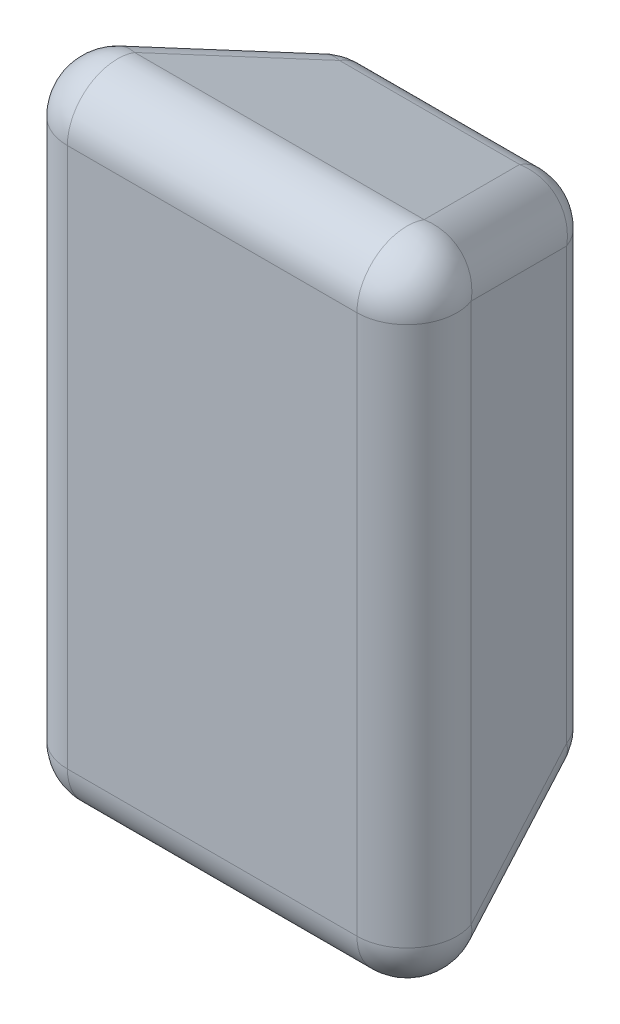
ISO-10303-21;
HEADER;
FILE_DESCRIPTION(('STEP AP214'),'2;1');
FILE_NAME('part.step','',(''),(''),'','','');
FILE_SCHEMA(('AUTOMOTIVE_DESIGN { 1 0 10303 214 1 1 1 1 }'));
ENDSEC;
DATA;
#1=APPLICATION_CONTEXT('core data for automotive mechanical design processes');
#2=APPLICATION_PROTOCOL_DEFINITION('international standard','automotive_design',2000,#1);
#3=PRODUCT_CONTEXT('',#1,'mechanical');
#4=PRODUCT('Part','Part','',(#3));
#5=PRODUCT_RELATED_PRODUCT_CATEGORY('part','',(#4));
#6=PRODUCT_DEFINITION_FORMATION('','',#4);
#7=PRODUCT_DEFINITION_CONTEXT('part definition',#1,'design');
#8=PRODUCT_DEFINITION('design','',#6,#7);
#9=PRODUCT_DEFINITION_SHAPE('','',#8);
#10=(LENGTH_UNIT() NAMED_UNIT(*) SI_UNIT(.MILLI.,.METRE.));
#11=(NAMED_UNIT(*) PLANE_ANGLE_UNIT() SI_UNIT($,.RADIAN.));
#12=(NAMED_UNIT(*) SI_UNIT($,.STERADIAN.) SOLID_ANGLE_UNIT());
#13=UNCERTAINTY_MEASURE_WITH_UNIT(LENGTH_MEASURE(1.E-05),#10,'distance_accuracy_value','');
#14=(GEOMETRIC_REPRESENTATION_CONTEXT(3) GLOBAL_UNCERTAINTY_ASSIGNED_CONTEXT((#13)) GLOBAL_UNIT_ASSIGNED_CONTEXT((#10,
#11,#12)) REPRESENTATION_CONTEXT('',''));
#15=CARTESIAN_POINT('',(0.,0.,0.));
#16=DIRECTION('',(0.,0.,1.));
#17=DIRECTION('',(1.,0.,0.));
#18=AXIS2_PLACEMENT_3D('',#15,#16,#17);
#19=CARTESIAN_POINT('',(-28.2934494803903,-54.2371973661256,0.));
#20=DIRECTION('',(-0.939692620785908,0.,-0.342020143325669));
#21=DIRECTION('',(-0.342020143325669,0.,0.939692620785909));
#22=AXIS2_PLACEMENT_3D('',#19,#20,#21);
#23=PLANE('',#22);
#24=DIRECTION('',(-0.323615577118185,-0.323615577118185,0.889126490715988));
#25=VECTOR('',#24,1.);
#26=CARTESIAN_POINT('',(-18.804857588362,-135.351679266238,-26.0696919657677));
#27=LINE('',#26,#25);
#28=CARTESIAN_POINT('',(-30.6883003061523,-147.235121984029,6.57979856674331));
#29=VERTEX_POINT('',#28);
#30=CARTESIAN_POINT('',(-41.6074073341383,-158.154229012015,36.5797985667433));
#31=VERTEX_POINT('',#30);
#32=EDGE_CURVE('E168',#29,#31,#27,.T.);
#33=ORIENTED_EDGE('',*,*,#32,.T.);
#34=DIRECTION('',(0.,-1.,0.));
#35=VECTOR('',#34,1.);
#36=CARTESIAN_POINT('',(-41.6074073341383,-36.0386856528155,36.5797985667433));
#37=LINE('',#36,#35);
#38=CARTESIAN_POINT('',(-41.6074073341383,-50.3201657202367,36.5797985667433));
#39=VERTEX_POINT('',#38);
#40=EDGE_CURVE('E170',#31,#39,#37,.F.);
#41=ORIENTED_EDGE('',*,*,#40,.T.);
#42=DIRECTION('',(0.323615577118185,-0.323615577118185,-0.889126490715988));
#43=VECTOR('',#42,1.);
#44=CARTESIAN_POINT('',(-29.2775617637156,-62.6500112906594,2.70382627664434));
#45=LINE('',#44,#43);
#46=CARTESIAN_POINT('',(-30.6883003061522,-61.2392727482227,6.57979856674331));
#47=VERTEX_POINT('',#46);
#48=EDGE_CURVE('E164',#39,#47,#45,.T.);
#49=ORIENTED_EDGE('',*,*,#48,.T.);
#50=DIRECTION('',(0.,-1.,0.));
#51=VECTOR('',#50,1.);
#52=CARTESIAN_POINT('',(-30.6883003061522,-54.2371973661256,6.57979856674331));
#53=LINE('',#52,#51);
#54=EDGE_CURVE('E166',#47,#29,#53,.T.);
#55=ORIENTED_EDGE('',*,*,#54,.T.);
#56=EDGE_LOOP('',(#33,#41,#49,#55));
#57=FACE_BOUND('',#56,.T.);
#58=ADVANCED_FACE('F33',(#57),#23,.T.);
#59=CARTESIAN_POINT('',(-28.2934494803903,-154.237197366126,0.));
#60=DIRECTION('',(0.,-0.939692620785908,-0.342020143325669));
#61=DIRECTION('',(0.,0.342020143325669,-0.939692620785909));
#62=AXIS2_PLACEMENT_3D('',#59,#60,#61);
#63=PLANE('',#62);
#64=DIRECTION('',(-0.323615577118185,0.323615577118185,-0.889126490715988));
#65=VECTOR('',#64,1.);
#66=CARTESIAN_POINT('',(31.4922483083862,-173.419821362761,52.7038262766443));
#67=LINE('',#66,#65);
#68=CARTESIAN_POINT('',(14.7044751375127,-156.632048191888,6.57979856674331));
#69=VERTEX_POINT('',#68);
#70=CARTESIAN_POINT('',(25.6235821654987,-167.551155219874,36.5797985667433));
#71=VERTEX_POINT('',#70);
#72=EDGE_CURVE('E173',#69,#71,#67,.F.);
#73=ORIENTED_EDGE('',*,*,#72,.T.);
#74=DIRECTION('',(1.,0.,0.));
#75=VECTOR('',#74,1.);
#76=CARTESIAN_POINT('',(-46.4919611937004,-167.551155219874,36.5797985667433));
#77=LINE('',#76,#75);
#78=CARTESIAN_POINT('',(-32.2104811262793,-167.551155219874,36.5797985667433));
#79=VERTEX_POINT('',#78);
#80=EDGE_CURVE('E179',#71,#79,#77,.F.);
#81=ORIENTED_EDGE('',*,*,#80,.T.);
#82=DIRECTION('',(-0.323615577118185,-0.323615577118185,0.889126490715988));
#83=VECTOR('',#82,1.);
#84=CARTESIAN_POINT('',(-19.8806355558565,-155.221309649451,2.70382627664433));
#85=LINE('',#84,#83);
#86=CARTESIAN_POINT('',(-21.2913740982932,-156.632048191888,6.57979856674331));
#87=VERTEX_POINT('',#86);
#88=EDGE_CURVE('E177',#79,#87,#85,.F.);
#89=ORIENTED_EDGE('',*,*,#88,.T.);
#90=DIRECTION('',(1.,0.,0.));
#91=VECTOR('',#90,1.);
#92=CARTESIAN_POINT('',(-28.2934494803903,-156.632048191888,6.57979856674331));
#93=LINE('',#92,#91);
#94=EDGE_CURVE('E175',#87,#69,#93,.T.);
#95=ORIENTED_EDGE('',*,*,#94,.T.);
#96=EDGE_LOOP('',(#73,#81,#89,#95));
#97=FACE_BOUND('',#96,.T.);
#98=ADVANCED_FACE('F267',(#97),#63,.T.);
#99=CARTESIAN_POINT('',(21.7065505196098,-54.2371973661256,0.));
#100=DIRECTION('',(0.939692620785908,0.,-0.342020143325669));
#101=DIRECTION('',(-0.342020143325669,0.,-0.939692620785909));
#102=AXIS2_PLACEMENT_3D('',#99,#100,#101);
#103=PLANE('',#102);
#104=DIRECTION('',(0.,-1.,0.));
#105=VECTOR('',#104,1.);
#106=CARTESIAN_POINT('',(24.1014013453717,-54.2371973661256,6.57979856674331));
#107=LINE('',#106,#105);
#108=CARTESIAN_POINT('',(24.1014013453718,-147.235121984029,6.57979856674331));
#109=VERTEX_POINT('',#108);
#110=CARTESIAN_POINT('',(24.1014013453717,-61.2392727482227,6.57979856674331));
#111=VERTEX_POINT('',#110);
#112=EDGE_CURVE('E194',#109,#111,#107,.F.);
#113=ORIENTED_EDGE('',*,*,#112,.T.);
#114=DIRECTION('',(-0.323615577118185,-0.323615577118185,-0.889126490715988));
#115=VECTOR('',#114,1.);
#116=CARTESIAN_POINT('',(22.6906628029351,-62.6500112906594,2.70382627664434));
#117=LINE('',#116,#115);
#118=CARTESIAN_POINT('',(35.0205083733578,-50.3201657202367,36.5797985667433));
#119=VERTEX_POINT('',#118);
#120=EDGE_CURVE('E197',#111,#119,#117,.F.);
#121=ORIENTED_EDGE('',*,*,#120,.T.);
#122=DIRECTION('',(0.,-1.,0.));
#123=VECTOR('',#122,1.);
#124=CARTESIAN_POINT('',(35.0205083733578,-54.2371973661256,36.5797985667433));
#125=LINE('',#124,#123);
#126=CARTESIAN_POINT('',(35.0205083733578,-158.154229012015,36.5797985667433));
#127=VERTEX_POINT('',#126);
#128=EDGE_CURVE('E139',#119,#127,#125,.T.);
#129=ORIENTED_EDGE('',*,*,#128,.T.);
#130=DIRECTION('',(0.323615577118185,-0.323615577118185,0.889126490715988));
#131=VECTOR('',#130,1.);
#132=CARTESIAN_POINT('',(22.6906628029351,-145.824383441592,2.70382627664433));
#133=LINE('',#132,#131);
#134=EDGE_CURVE('E191',#127,#109,#133,.F.);
#135=ORIENTED_EDGE('',*,*,#134,.T.);
#136=EDGE_LOOP('',(#113,#121,#129,#135));
#137=FACE_BOUND('',#136,.T.);
#138=ADVANCED_FACE('F298',(#137),#103,.T.);
#139=CARTESIAN_POINT('',(-28.2934494803903,-54.2371973661256,0.));
#140=DIRECTION('',(0.,0.939692620785908,-0.342020143325669));
#141=DIRECTION('',(0.,0.342020143325669,0.939692620785909));
#142=AXIS2_PLACEMENT_3D('',#139,#140,#141);
#143=PLANE('',#142);
#144=DIRECTION('',(1.,0.,0.));
#145=VECTOR('',#144,1.);
#146=CARTESIAN_POINT('',(-28.2934494803903,-51.8423465403637,6.57979856674331));
#147=LINE('',#146,#145);
#148=CARTESIAN_POINT('',(14.7044751375127,-51.8423465403637,6.57979856674331));
#149=VERTEX_POINT('',#148);
#150=CARTESIAN_POINT('',(-21.2913740982932,-51.8423465403637,6.57979856674331));
#151=VERTEX_POINT('',#150);
#152=EDGE_CURVE('E42',#149,#151,#147,.F.);
#153=ORIENTED_EDGE('',*,*,#152,.T.);
#154=DIRECTION('',(-0.323615577118185,0.323615577118185,0.889126490715988));
#155=VECTOR('',#154,1.);
#156=CARTESIAN_POINT('',(-38.0791472691667,-35.0545733694902,52.7038262766443));
#157=LINE('',#156,#155);
#158=CARTESIAN_POINT('',(-32.2104811262792,-40.9232395123776,36.5797985667433));
#159=VERTEX_POINT('',#158);
#160=EDGE_CURVE('E11',#151,#159,#157,.T.);
#161=ORIENTED_EDGE('',*,*,#160,.T.);
#162=DIRECTION('',(1.,0.,0.));
#163=VECTOR('',#162,1.);
#164=CARTESIAN_POINT('',(-28.2934494803903,-40.9232395123776,36.5797985667433));
#165=LINE('',#164,#163);
#166=CARTESIAN_POINT('',(25.6235821654987,-40.9232395123776,36.5797985667433));
#167=VERTEX_POINT('',#166);
#168=EDGE_CURVE('E201',#159,#167,#165,.T.);
#169=ORIENTED_EDGE('',*,*,#168,.T.);
#170=DIRECTION('',(-0.323615577118185,-0.323615577118185,-0.889126490715988));
#171=VECTOR('',#170,1.);
#172=CARTESIAN_POINT('',(8.05738450739923,-58.4894371704771,-11.6829328445617));
#173=LINE('',#172,#171);
#174=EDGE_CURVE('E199',#167,#149,#173,.T.);
#175=ORIENTED_EDGE('',*,*,#174,.T.);
#176=EDGE_LOOP('',(#153,#161,#169,#175));
#177=FACE_BOUND('',#176,.T.);
#178=ADVANCED_FACE('F300',(#177),#143,.T.);
#179=CARTESIAN_POINT('',(0.,0.,50.));
#180=DIRECTION('',(0.,0.,1.));
#181=DIRECTION('',(1.,0.,0.));
#182=AXIS2_PLACEMENT_3D('',#179,#180,#181);
#183=PLANE('',#182);
#184=DIRECTION('',(1.,0.,0.));
#185=VECTOR('',#184,1.);
#186=CARTESIAN_POINT('',(0.,-50.3201657202367,50.));
#187=LINE('',#186,#185);
#188=CARTESIAN_POINT('',(25.6235821654987,-50.3201657202367,50.));
#189=VERTEX_POINT('',#188);
#190=CARTESIAN_POINT('',(-32.2104811262792,-50.3201657202367,50.));
#191=VERTEX_POINT('',#190);
#192=EDGE_CURVE('E126',#189,#191,#187,.F.);
#193=ORIENTED_EDGE('',*,*,#192,.T.);
#194=DIRECTION('',(0.,1.,0.));
#195=VECTOR('',#194,1.);
#196=CARTESIAN_POINT('',(-32.2104811262792,-172.435709079436,50.));
#197=LINE('',#196,#195);
#198=CARTESIAN_POINT('',(-32.2104811262792,-158.154229012015,50.));
#199=VERTEX_POINT('',#198);
#200=EDGE_CURVE('E162',#191,#199,#197,.F.);
#201=ORIENTED_EDGE('',*,*,#200,.T.);
#202=DIRECTION('',(-1.,0.,0.));
#203=VECTOR('',#202,1.);
#204=CARTESIAN_POINT('',(39.9050622329199,-158.154229012015,50.));
#205=LINE('',#204,#203);
#206=CARTESIAN_POINT('',(25.6235821654987,-158.154229012015,50.));
#207=VERTEX_POINT('',#206);
#208=EDGE_CURVE('E129',#199,#207,#205,.F.);
#209=ORIENTED_EDGE('',*,*,#208,.T.);
#210=DIRECTION('',(0.,-1.,0.));
#211=VECTOR('',#210,1.);
#212=CARTESIAN_POINT('',(25.6235821654987,0.,50.));
#213=LINE('',#212,#211);
#214=EDGE_CURVE('E121',#207,#189,#213,.F.);
#215=ORIENTED_EDGE('',*,*,#214,.T.);
#216=EDGE_LOOP('',(#193,#201,#209,#215));
#217=FACE_BOUND('',#216,.T.);
#218=ADVANCED_FACE('F123',(#217),#183,.T.);
#219=CARTESIAN_POINT('',(0.,0.,0.));
#220=DIRECTION('',(0.,0.,1.));
#221=DIRECTION('',(1.,0.,0.));
#222=AXIS2_PLACEMENT_3D('',#219,#220,#221);
#223=PLANE('',#222);
#224=DIRECTION('',(-1.,0.,0.));
#225=VECTOR('',#224,1.);
#226=CARTESIAN_POINT('',(0.,-147.235121984029,0.));
#227=LINE('',#226,#225);
#228=CARTESIAN_POINT('',(14.7044751375127,-147.235121984029,0.));
#229=VERTEX_POINT('',#228);
#230=CARTESIAN_POINT('',(-21.2913740982932,-147.235121984029,0.));
#231=VERTEX_POINT('',#230);
#232=EDGE_CURVE('E186',#229,#231,#227,.T.);
#233=ORIENTED_EDGE('',*,*,#232,.T.);
#234=DIRECTION('',(0.,1.,0.));
#235=VECTOR('',#234,1.);
#236=CARTESIAN_POINT('',(-21.2913740982932,0.,0.));
#237=LINE('',#236,#235);
#238=CARTESIAN_POINT('',(-21.2913740982932,-61.2392727482228,0.));
#239=VERTEX_POINT('',#238);
#240=EDGE_CURVE('E188',#231,#239,#237,.T.);
#241=ORIENTED_EDGE('',*,*,#240,.T.);
#242=DIRECTION('',(1.,0.,0.));
#243=VECTOR('',#242,1.);
#244=CARTESIAN_POINT('',(21.7065505196098,-61.2392727482228,0.));
#245=LINE('',#244,#243);
#246=CARTESIAN_POINT('',(14.7044751375127,-61.2392727482228,0.));
#247=VERTEX_POINT('',#246);
#248=EDGE_CURVE('E182',#239,#247,#245,.T.);
#249=ORIENTED_EDGE('',*,*,#248,.T.);
#250=DIRECTION('',(0.,-1.,0.));
#251=VECTOR('',#250,1.);
#252=CARTESIAN_POINT('',(14.7044751375127,-154.237197366126,0.));
#253=LINE('',#252,#251);
#254=EDGE_CURVE('E184',#247,#229,#253,.T.);
#255=ORIENTED_EDGE('',*,*,#254,.T.);
#256=EDGE_LOOP('',(#233,#241,#249,#255));
#257=FACE_BOUND('',#256,.T.);
#258=ADVANCED_FACE('F276',(#257),#223,.F.);
#259=CARTESIAN_POINT('',(14.7044751375126,0.,10.));
#260=DIRECTION('',(0.,1.,0.));
#261=DIRECTION('',(-1.,0.,0.));
#262=AXIS2_PLACEMENT_3D('',#259,#260,#261);
#263=CYLINDRICAL_SURFACE('',#262,10.);
#264=CARTESIAN_POINT('',(14.7044751375127,-61.2392727482227,10.));
#265=DIRECTION('',(0.,1.,0.));
#266=DIRECTION('',(0.,0.,1.));
#267=AXIS2_PLACEMENT_3D('',#264,#265,#266);
#268=CIRCLE('',#267,10.);
#269=EDGE_CURVE('E37',#111,#247,#268,.T.);
#270=ORIENTED_EDGE('',*,*,#269,.F.);
#271=ORIENTED_EDGE('',*,*,#112,.F.);
#272=CARTESIAN_POINT('',(14.7044751375127,-147.235121984029,10.));
#273=DIRECTION('',(0.,-1.,0.));
#274=DIRECTION('',(1.,0.,0.));
#275=AXIS2_PLACEMENT_3D('',#272,#273,#274);
#276=CIRCLE('',#275,10.);
#277=EDGE_CURVE('E159',#229,#109,#276,.T.);
#278=ORIENTED_EDGE('',*,*,#277,.F.);
#279=ORIENTED_EDGE('',*,*,#254,.F.);
#280=EDGE_LOOP('',(#270,#271,#278,#279));
#281=FACE_BOUND('',#280,.T.);
#282=ADVANCED_FACE('F35',(#281),#263,.T.);
#283=CARTESIAN_POINT('',(14.7044751375127,-61.2392727482228,10.));
#284=DIRECTION('',(0.,0.,1.));
#285=DIRECTION('',(1.,0.,0.));
#286=AXIS2_PLACEMENT_3D('',#283,#284,#285);
#287=SPHERICAL_SURFACE('',#286,10.);
#288=CARTESIAN_POINT('',(14.7044751375127,-61.2392727482227,10.));
#289=DIRECTION('',(-0.323615577118184,-0.323615577118185,-0.889126490715988));
#290=DIRECTION('',(0.,0.939692620785908,-0.342020143325669));
#291=AXIS2_PLACEMENT_3D('',#288,#289,#290);
#292=CIRCLE('',#291,10.);
#293=EDGE_CURVE('E245',#111,#149,#292,.F.);
#294=ORIENTED_EDGE('',*,*,#293,.F.);
#295=ORIENTED_EDGE('',*,*,#269,.T.);
#296=CARTESIAN_POINT('',(14.7044751375127,-61.2392727482228,10.));
#297=DIRECTION('',(1.,0.,0.));
#298=DIRECTION('',(0.,1.,0.));
#299=AXIS2_PLACEMENT_3D('',#296,#297,#298);
#300=CIRCLE('',#299,10.);
#301=EDGE_CURVE('E248',#149,#247,#300,.F.);
#302=ORIENTED_EDGE('',*,*,#301,.F.);
#303=EDGE_LOOP('',(#294,#295,#302));
#304=FACE_BOUND('',#303,.T.);
#305=ADVANCED_FACE('F293',(#304),#287,.T.);
#306=CARTESIAN_POINT('',(14.7044751375127,-147.235121984029,10.));
#307=DIRECTION('',(0.,0.,1.));
#308=DIRECTION('',(1.,0.,0.));
#309=AXIS2_PLACEMENT_3D('',#306,#307,#308);
#310=SPHERICAL_SURFACE('',#309,10.);
#311=CARTESIAN_POINT('',(14.7044751375127,-147.235121984029,10.));
#312=DIRECTION('',(1.,0.,0.));
#313=DIRECTION('',(0.,1.,0.));
#314=AXIS2_PLACEMENT_3D('',#311,#312,#313);
#315=CIRCLE('',#314,10.);
#316=EDGE_CURVE('E239',#229,#69,#315,.F.);
#317=ORIENTED_EDGE('',*,*,#316,.F.);
#318=ORIENTED_EDGE('',*,*,#277,.T.);
#319=CARTESIAN_POINT('',(14.7044751375127,-147.235121984029,10.));
#320=DIRECTION('',(-0.323615577118185,0.323615577118186,-0.889126490715988));
#321=DIRECTION('',(0.,0.939692620785908,0.34202014332567));
#322=AXIS2_PLACEMENT_3D('',#319,#320,#321);
#323=CIRCLE('',#322,10.);
#324=EDGE_CURVE('E242',#69,#109,#323,.F.);
#325=ORIENTED_EDGE('',*,*,#324,.F.);
#326=EDGE_LOOP('',(#317,#318,#325));
#327=FACE_BOUND('',#326,.T.);
#328=ADVANCED_FACE('F255',(#327),#310,.T.);
#329=CARTESIAN_POINT('',(0.,-61.2392727482228,10.));
#330=DIRECTION('',(-1.,0.,0.));
#331=DIRECTION('',(0.,0.,1.));
#332=AXIS2_PLACEMENT_3D('',#329,#330,#331);
#333=CYLINDRICAL_SURFACE('',#332,10.);
#334=ORIENTED_EDGE('',*,*,#301,.T.);
#335=ORIENTED_EDGE('',*,*,#248,.F.);
#336=CARTESIAN_POINT('',(-21.2913740982932,-61.2392727482227,10.));
#337=DIRECTION('',(-1.,0.,0.));
#338=DIRECTION('',(0.,0.,1.));
#339=AXIS2_PLACEMENT_3D('',#336,#337,#338);
#340=CIRCLE('',#339,10.);
#341=EDGE_CURVE('E234',#151,#239,#340,.T.);
#342=ORIENTED_EDGE('',*,*,#341,.F.);
#343=ORIENTED_EDGE('',*,*,#152,.F.);
#344=EDGE_LOOP('',(#334,#335,#342,#343));
#345=FACE_BOUND('',#344,.T.);
#346=ADVANCED_FACE('F287',(#345),#333,.T.);
#347=CARTESIAN_POINT('',(8.05738450739923,-67.8863633783362,-8.26273141130502));
#348=DIRECTION('',(-0.323615577118185,-0.323615577118185,-0.889126490715988));
#349=DIRECTION('',(0.,0.939692620785908,-0.342020143325669));
#350=AXIS2_PLACEMENT_3D('',#347,#348,#349);
#351=CYLINDRICAL_SURFACE('',#350,10.);
#352=ORIENTED_EDGE('',*,*,#293,.T.);
#353=ORIENTED_EDGE('',*,*,#174,.F.);
#354=CARTESIAN_POINT('',(25.6235821654987,-50.3201657202367,40.));
#355=DIRECTION('',(0.323615577118185,0.323615577118185,0.889126490715988));
#356=DIRECTION('',(0.,-0.939692620785908,0.342020143325669));
#357=AXIS2_PLACEMENT_3D('',#354,#355,#356);
#358=CIRCLE('',#357,10.);
#359=EDGE_CURVE('E143',#119,#167,#358,.T.);
#360=ORIENTED_EDGE('',*,*,#359,.F.);
#361=ORIENTED_EDGE('',*,*,#120,.F.);
#362=EDGE_LOOP('',(#352,#353,#360,#361));
#363=FACE_BOUND('',#362,.T.);
#364=ADVANCED_FACE('F296',(#363),#351,.T.);
#365=CARTESIAN_POINT('',(25.6235821654987,-54.2371973661256,40.));
#366=DIRECTION('',(0.,-1.,0.));
#367=DIRECTION('',(1.,0.,0.));
#368=AXIS2_PLACEMENT_3D('',#365,#366,#367);
#369=CYLINDRICAL_SURFACE('',#368,10.);
#370=CARTESIAN_POINT('',(25.6235821654987,-158.154229012015,40.));
#371=DIRECTION('',(0.,-1.,0.));
#372=DIRECTION('',(0.,0.,-1.));
#373=AXIS2_PLACEMENT_3D('',#370,#371,#372);
#374=CIRCLE('',#373,10.);
#375=EDGE_CURVE('E144',#127,#207,#374,.T.);
#376=ORIENTED_EDGE('',*,*,#375,.F.);
#377=ORIENTED_EDGE('',*,*,#128,.F.);
#378=CARTESIAN_POINT('',(25.6235821654987,-50.3201657202367,40.));
#379=DIRECTION('',(0.,1.,0.));
#380=DIRECTION('',(-1.,0.,0.));
#381=AXIS2_PLACEMENT_3D('',#378,#379,#380);
#382=CIRCLE('',#381,10.);
#383=EDGE_CURVE('E136',#189,#119,#382,.T.);
#384=ORIENTED_EDGE('',*,*,#383,.F.);
#385=ORIENTED_EDGE('',*,*,#214,.F.);
#386=EDGE_LOOP('',(#376,#377,#384,#385));
#387=FACE_BOUND('',#386,.T.);
#388=ADVANCED_FACE('F138',(#387),#369,.T.);
#389=CARTESIAN_POINT('',(2.82103241972244,-135.351679266238,-22.6494905325111));
#390=DIRECTION('',(-0.323615577118185,0.323615577118185,-0.889126490715988));
#391=DIRECTION('',(0.,0.939692620785908,0.342020143325669));
#392=AXIS2_PLACEMENT_3D('',#389,#390,#391);
#393=CYLINDRICAL_SURFACE('',#392,10.);
#394=ORIENTED_EDGE('',*,*,#324,.T.);
#395=ORIENTED_EDGE('',*,*,#134,.F.);
#396=CARTESIAN_POINT('',(25.6235821654987,-158.154229012015,40.));
#397=DIRECTION('',(0.323615577118184,-0.323615577118185,0.889126490715988));
#398=DIRECTION('',(0.,-0.939692620785908,-0.342020143325669));
#399=AXIS2_PLACEMENT_3D('',#396,#397,#398);
#400=CIRCLE('',#399,10.);
#401=EDGE_CURVE('E229',#71,#127,#400,.T.);
#402=ORIENTED_EDGE('',*,*,#401,.F.);
#403=ORIENTED_EDGE('',*,*,#72,.F.);
#404=EDGE_LOOP('',(#394,#395,#402,#403));
#405=FACE_BOUND('',#404,.T.);
#406=ADVANCED_FACE('F263',(#405),#393,.T.);
#407=CARTESIAN_POINT('',(-28.2934494803903,-147.235121984029,10.));
#408=DIRECTION('',(-1.,0.,0.));
#409=DIRECTION('',(0.,-1.,0.));
#410=AXIS2_PLACEMENT_3D('',#407,#408,#409);
#411=CYLINDRICAL_SURFACE('',#410,10.);
#412=ORIENTED_EDGE('',*,*,#316,.T.);
#413=ORIENTED_EDGE('',*,*,#94,.F.);
#414=CARTESIAN_POINT('',(-21.2913740982932,-147.235121984029,10.));
#415=DIRECTION('',(-1.,0.,0.));
#416=DIRECTION('',(0.,-1.,0.));
#417=AXIS2_PLACEMENT_3D('',#414,#415,#416);
#418=CIRCLE('',#417,10.);
#419=EDGE_CURVE('E226',#231,#87,#418,.T.);
#420=ORIENTED_EDGE('',*,*,#419,.F.);
#421=ORIENTED_EDGE('',*,*,#232,.F.);
#422=EDGE_LOOP('',(#412,#413,#420,#421));
#423=FACE_BOUND('',#422,.T.);
#424=ADVANCED_FACE('F273',(#423),#411,.T.);
#425=CARTESIAN_POINT('',(-21.2913740982932,-54.2371973661256,10.));
#426=DIRECTION('',(0.,1.,0.));
#427=DIRECTION('',(-1.,0.,0.));
#428=AXIS2_PLACEMENT_3D('',#425,#426,#427);
#429=CYLINDRICAL_SURFACE('',#428,10.);
#430=CARTESIAN_POINT('',(-21.2913740982932,-61.2392727482228,10.));
#431=DIRECTION('',(0.,1.,0.));
#432=DIRECTION('',(-1.,0.,0.));
#433=AXIS2_PLACEMENT_3D('',#430,#431,#432);
#434=CIRCLE('',#433,10.);
#435=EDGE_CURVE('E236',#239,#47,#434,.T.);
#436=ORIENTED_EDGE('',*,*,#435,.F.);
#437=ORIENTED_EDGE('',*,*,#240,.F.);
#438=CARTESIAN_POINT('',(-21.2913740982932,-147.235121984029,10.));
#439=DIRECTION('',(0.,-1.,0.));
#440=DIRECTION('',(0.,0.,-1.));
#441=AXIS2_PLACEMENT_3D('',#438,#439,#440);
#442=CIRCLE('',#441,10.);
#443=EDGE_CURVE('E223',#29,#231,#442,.T.);
#444=ORIENTED_EDGE('',*,*,#443,.F.);
#445=ORIENTED_EDGE('',*,*,#54,.F.);
#446=EDGE_LOOP('',(#436,#437,#444,#445));
#447=FACE_BOUND('',#446,.T.);
#448=ADVANCED_FACE('F280',(#447),#429,.T.);
#449=CARTESIAN_POINT('',(-21.2913740982932,-61.2392727482228,10.));
#450=DIRECTION('',(0.,0.,1.));
#451=DIRECTION('',(1.,0.,0.));
#452=AXIS2_PLACEMENT_3D('',#449,#450,#451);
#453=SPHERICAL_SURFACE('',#452,10.);
#454=ORIENTED_EDGE('',*,*,#341,.T.);
#455=ORIENTED_EDGE('',*,*,#435,.T.);
#456=CARTESIAN_POINT('',(-21.2913740982932,-61.2392727482227,10.));
#457=DIRECTION('',(0.323615577118185,-0.323615577118185,-0.889126490715988));
#458=DIRECTION('',(0.,0.939692620785908,-0.342020143325669));
#459=AXIS2_PLACEMENT_3D('',#456,#457,#458);
#460=CIRCLE('',#459,10.);
#461=EDGE_CURVE('E150',#151,#47,#460,.F.);
#462=ORIENTED_EDGE('',*,*,#461,.F.);
#463=EDGE_LOOP('',(#454,#455,#462));
#464=FACE_BOUND('',#463,.T.);
#465=ADVANCED_FACE('F394',(#464),#453,.T.);
#466=CARTESIAN_POINT('',(25.6235821654987,-50.3201657202367,40.));
#467=DIRECTION('',(0.,0.,1.));
#468=DIRECTION('',(1.,0.,0.));
#469=AXIS2_PLACEMENT_3D('',#466,#467,#468);
#470=SPHERICAL_SURFACE('',#469,10.);
#471=ORIENTED_EDGE('',*,*,#383,.T.);
#472=ORIENTED_EDGE('',*,*,#359,.T.);
#473=CARTESIAN_POINT('',(25.6235821654987,-50.3201657202367,40.));
#474=DIRECTION('',(1.,0.,0.));
#475=DIRECTION('',(0.,0.,-1.));
#476=AXIS2_PLACEMENT_3D('',#473,#474,#475);
#477=CIRCLE('',#476,10.);
#478=EDGE_CURVE('E147',#189,#167,#477,.F.);
#479=ORIENTED_EDGE('',*,*,#478,.F.);
#480=EDGE_LOOP('',(#471,#472,#479));
#481=FACE_BOUND('',#480,.T.);
#482=ADVANCED_FACE('F148',(#481),#470,.T.);
#483=CARTESIAN_POINT('',(25.6235821654987,-158.154229012015,40.));
#484=DIRECTION('',(0.,0.,1.));
#485=DIRECTION('',(1.,0.,0.));
#486=AXIS2_PLACEMENT_3D('',#483,#484,#485);
#487=SPHERICAL_SURFACE('',#486,10.);
#488=ORIENTED_EDGE('',*,*,#401,.T.);
#489=ORIENTED_EDGE('',*,*,#375,.T.);
#490=CARTESIAN_POINT('',(25.6235821654987,-158.154229012015,40.));
#491=DIRECTION('',(1.,0.,0.));
#492=DIRECTION('',(0.,1.,0.));
#493=AXIS2_PLACEMENT_3D('',#490,#491,#492);
#494=CIRCLE('',#493,10.);
#495=EDGE_CURVE('E151',#71,#207,#494,.F.);
#496=ORIENTED_EDGE('',*,*,#495,.F.);
#497=EDGE_LOOP('',(#488,#489,#496));
#498=FACE_BOUND('',#497,.T.);
#499=ADVANCED_FACE('F411',(#498),#487,.T.);
#500=CARTESIAN_POINT('',(-21.2913740982932,-147.235121984029,10.));
#501=DIRECTION('',(0.,0.,1.));
#502=DIRECTION('',(1.,0.,0.));
#503=AXIS2_PLACEMENT_3D('',#500,#501,#502);
#504=SPHERICAL_SURFACE('',#503,10.);
#505=ORIENTED_EDGE('',*,*,#443,.T.);
#506=ORIENTED_EDGE('',*,*,#419,.T.);
#507=CARTESIAN_POINT('',(-21.2913740982932,-147.235121984029,10.));
#508=DIRECTION('',(0.323615577118186,0.323615577118184,-0.889126490715988));
#509=DIRECTION('',(-0.939692620785908,0.,-0.34202014332567));
#510=AXIS2_PLACEMENT_3D('',#507,#508,#509);
#511=CIRCLE('',#510,10.);
#512=EDGE_CURVE('E217',#29,#87,#511,.F.);
#513=ORIENTED_EDGE('',*,*,#512,.F.);
#514=EDGE_LOOP('',(#505,#506,#513));
#515=FACE_BOUND('',#514,.T.);
#516=ADVANCED_FACE('F420',(#515),#504,.T.);
#517=CARTESIAN_POINT('',(-19.8806355558565,-62.6500112906594,6.12402770990103));
#518=DIRECTION('',(0.323615577118185,-0.323615577118185,-0.889126490715988));
#519=DIRECTION('',(0.,0.939692620785908,-0.342020143325669));
#520=AXIS2_PLACEMENT_3D('',#517,#518,#519);
#521=CYLINDRICAL_SURFACE('',#520,10.);
#522=ORIENTED_EDGE('',*,*,#461,.T.);
#523=ORIENTED_EDGE('',*,*,#48,.F.);
#524=CARTESIAN_POINT('',(-32.2104811262792,-50.3201657202367,40.));
#525=DIRECTION('',(-0.323615577118185,0.323615577118185,0.889126490715988));
#526=DIRECTION('',(0.939692620785908,0.,0.342020143325669));
#527=AXIS2_PLACEMENT_3D('',#524,#525,#526);
#528=CIRCLE('',#527,10.);
#529=EDGE_CURVE('E214',#159,#39,#528,.T.);
#530=ORIENTED_EDGE('',*,*,#529,.F.);
#531=ORIENTED_EDGE('',*,*,#160,.F.);
#532=EDGE_LOOP('',(#522,#523,#530,#531));
#533=FACE_BOUND('',#532,.T.);
#534=ADVANCED_FACE('F430',(#533),#521,.T.);
#535=CARTESIAN_POINT('',(-28.2934494803903,-50.3201657202367,40.));
#536=DIRECTION('',(1.,0.,0.));
#537=DIRECTION('',(0.,0.,-1.));
#538=AXIS2_PLACEMENT_3D('',#535,#536,#537);
#539=CYLINDRICAL_SURFACE('',#538,10.);
#540=ORIENTED_EDGE('',*,*,#478,.T.);
#541=ORIENTED_EDGE('',*,*,#168,.F.);
#542=CARTESIAN_POINT('',(-32.2104811262792,-50.3201657202367,40.));
#543=DIRECTION('',(-1.,0.,0.));
#544=DIRECTION('',(0.,0.,1.));
#545=AXIS2_PLACEMENT_3D('',#542,#543,#544);
#546=CIRCLE('',#545,10.);
#547=EDGE_CURVE('E155',#191,#159,#546,.T.);
#548=ORIENTED_EDGE('',*,*,#547,.F.);
#549=ORIENTED_EDGE('',*,*,#192,.F.);
#550=EDGE_LOOP('',(#540,#541,#548,#549));
#551=FACE_BOUND('',#550,.T.);
#552=ADVANCED_FACE('F153',(#551),#539,.T.);
#553=CARTESIAN_POINT('',(0.,-158.154229012015,40.));
#554=DIRECTION('',(1.,0.,0.));
#555=DIRECTION('',(0.,1.,0.));
#556=AXIS2_PLACEMENT_3D('',#553,#554,#555);
#557=CYLINDRICAL_SURFACE('',#556,10.);
#558=ORIENTED_EDGE('',*,*,#495,.T.);
#559=ORIENTED_EDGE('',*,*,#208,.F.);
#560=CARTESIAN_POINT('',(-32.2104811262792,-158.154229012015,40.));
#561=DIRECTION('',(-1.,0.,0.));
#562=DIRECTION('',(0.,-1.,0.));
#563=AXIS2_PLACEMENT_3D('',#560,#561,#562);
#564=CIRCLE('',#563,10.);
#565=EDGE_CURVE('E210',#79,#199,#564,.T.);
#566=ORIENTED_EDGE('',*,*,#565,.F.);
#567=ORIENTED_EDGE('',*,*,#80,.F.);
#568=EDGE_LOOP('',(#558,#559,#566,#567));
#569=FACE_BOUND('',#568,.T.);
#570=ADVANCED_FACE('F448',(#569),#557,.T.);
#571=CARTESIAN_POINT('',(-19.8806355558565,-145.824383441592,6.12402770990102));
#572=DIRECTION('',(0.323615577118185,0.323615577118185,-0.889126490715988));
#573=DIRECTION('',(-0.939692620785908,0.,-0.342020143325669));
#574=AXIS2_PLACEMENT_3D('',#571,#572,#573);
#575=CYLINDRICAL_SURFACE('',#574,10.);
#576=ORIENTED_EDGE('',*,*,#512,.T.);
#577=ORIENTED_EDGE('',*,*,#88,.F.);
#578=CARTESIAN_POINT('',(-32.2104811262792,-158.154229012015,40.));
#579=DIRECTION('',(-0.323615577118185,-0.323615577118184,0.889126490715989));
#580=DIRECTION('',(0.939692620785908,0.,0.342020143325669));
#581=AXIS2_PLACEMENT_3D('',#578,#579,#580);
#582=CIRCLE('',#581,10.);
#583=EDGE_CURVE('E208',#31,#79,#582,.T.);
#584=ORIENTED_EDGE('',*,*,#583,.F.);
#585=ORIENTED_EDGE('',*,*,#32,.F.);
#586=EDGE_LOOP('',(#576,#577,#584,#585));
#587=FACE_BOUND('',#586,.T.);
#588=ADVANCED_FACE('F457',(#587),#575,.T.);
#589=CARTESIAN_POINT('',(-32.2104811262792,-50.3201657202367,40.));
#590=DIRECTION('',(0.,0.,1.));
#591=DIRECTION('',(1.,0.,0.));
#592=AXIS2_PLACEMENT_3D('',#589,#590,#591);
#593=SPHERICAL_SURFACE('',#592,10.);
#594=ORIENTED_EDGE('',*,*,#547,.T.);
#595=ORIENTED_EDGE('',*,*,#529,.T.);
#596=CARTESIAN_POINT('',(-32.2104811262792,-50.3201657202367,40.));
#597=DIRECTION('',(0.,1.,0.));
#598=DIRECTION('',(0.,0.,1.));
#599=AXIS2_PLACEMENT_3D('',#596,#597,#598);
#600=CIRCLE('',#599,10.);
#601=EDGE_CURVE('E206',#191,#39,#600,.F.);
#602=ORIENTED_EDGE('',*,*,#601,.F.);
#603=EDGE_LOOP('',(#594,#595,#602));
#604=FACE_BOUND('',#603,.T.);
#605=ADVANCED_FACE('F467',(#604),#593,.T.);
#606=CARTESIAN_POINT('',(-32.2104811262792,-158.154229012015,40.));
#607=DIRECTION('',(0.,0.,1.));
#608=DIRECTION('',(1.,0.,0.));
#609=AXIS2_PLACEMENT_3D('',#606,#607,#608);
#610=SPHERICAL_SURFACE('',#609,10.);
#611=ORIENTED_EDGE('',*,*,#583,.T.);
#612=ORIENTED_EDGE('',*,*,#565,.T.);
#613=CARTESIAN_POINT('',(-32.2104811262792,-158.154229012015,40.));
#614=DIRECTION('',(0.,-1.,0.));
#615=DIRECTION('',(1.,0.,0.));
#616=AXIS2_PLACEMENT_3D('',#613,#614,#615);
#617=CIRCLE('',#616,10.);
#618=EDGE_CURVE('E204',#31,#199,#617,.F.);
#619=ORIENTED_EDGE('',*,*,#618,.F.);
#620=EDGE_LOOP('',(#611,#612,#619));
#621=FACE_BOUND('',#620,.T.);
#622=ADVANCED_FACE('F477',(#621),#610,.T.);
#623=CARTESIAN_POINT('',(-32.2104811262792,0.,40.));
#624=DIRECTION('',(0.,-1.,0.));
#625=DIRECTION('',(1.,0.,0.));
#626=AXIS2_PLACEMENT_3D('',#623,#624,#625);
#627=CYLINDRICAL_SURFACE('',#626,10.);
#628=ORIENTED_EDGE('',*,*,#601,.T.);
#629=ORIENTED_EDGE('',*,*,#40,.F.);
#630=ORIENTED_EDGE('',*,*,#618,.T.);
#631=ORIENTED_EDGE('',*,*,#200,.F.);
#632=EDGE_LOOP('',(#628,#629,#630,#631));
#633=FACE_BOUND('',#632,.T.);
#634=ADVANCED_FACE('F487',(#633),#627,.T.);
#635=CLOSED_SHELL('',(#58,#98,#138,#178,#218,#258,#282,#305,#328,#346,#364,#388,#406,#424,#448,
#465,#482,#499,#516,#534,#552,#570,#588,#605,#622,#634));
#636=MANIFOLD_SOLID_BREP('B2',#635);
#637=ADVANCED_BREP_SHAPE_REPRESENTATION('',(#18,#636),#14);
#638=SHAPE_DEFINITION_REPRESENTATION(#9,#637);
ENDSEC;
END-ISO-10303-21;
